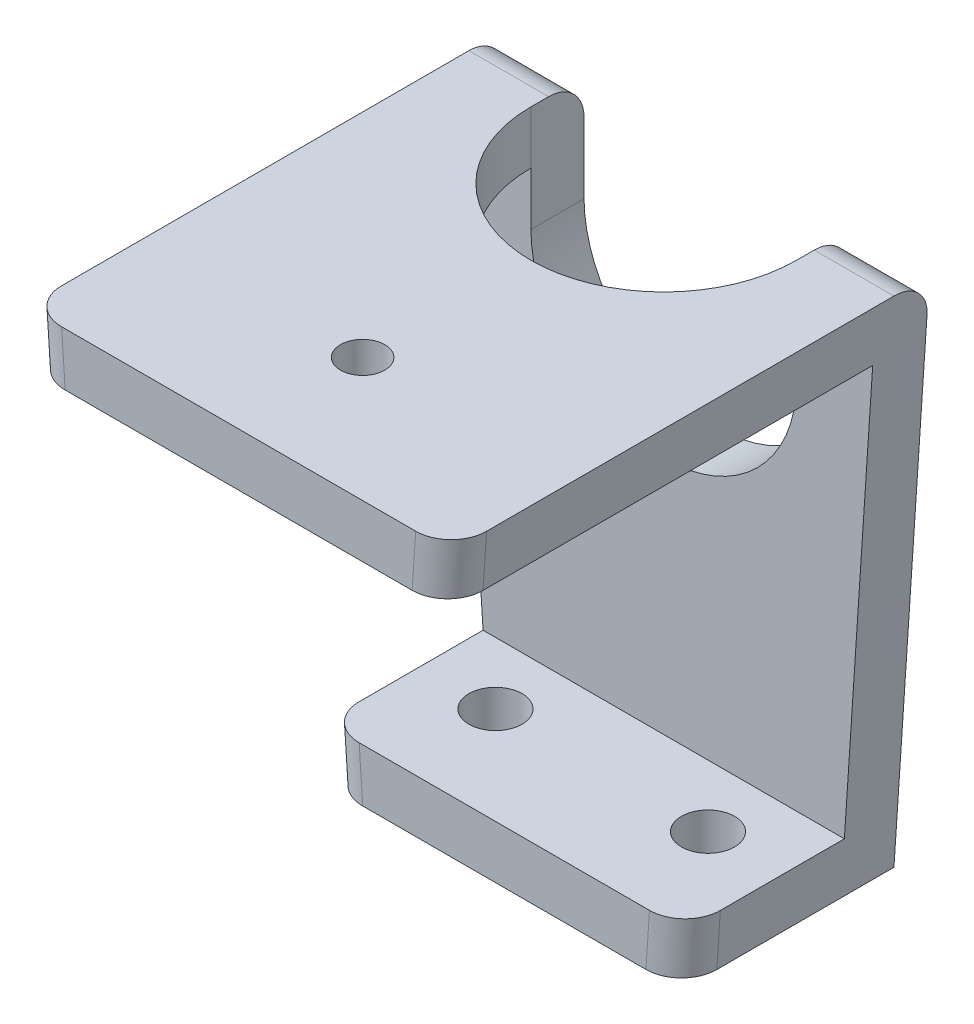
ISO-10303-21;
HEADER;
FILE_DESCRIPTION(('STEP AP214'),'2;1');
FILE_NAME('part.step','',(''),(''),'','','');
FILE_SCHEMA(('AUTOMOTIVE_DESIGN { 1 0 10303 214 1 1 1 1 }'));
ENDSEC;
DATA;
#1=APPLICATION_CONTEXT('core data for automotive mechanical design processes');
#2=APPLICATION_PROTOCOL_DEFINITION('international standard','automotive_design',2000,#1);
#3=PRODUCT_CONTEXT('',#1,'mechanical');
#4=PRODUCT('Part','Part','',(#3));
#5=PRODUCT_RELATED_PRODUCT_CATEGORY('part','',(#4));
#6=PRODUCT_DEFINITION_FORMATION('','',#4);
#7=PRODUCT_DEFINITION_CONTEXT('part definition',#1,'design');
#8=PRODUCT_DEFINITION('design','',#6,#7);
#9=PRODUCT_DEFINITION_SHAPE('','',#8);
#10=(LENGTH_UNIT() NAMED_UNIT(*) SI_UNIT(.MILLI.,.METRE.));
#11=(NAMED_UNIT(*) PLANE_ANGLE_UNIT() SI_UNIT($,.RADIAN.));
#12=(NAMED_UNIT(*) SI_UNIT($,.STERADIAN.) SOLID_ANGLE_UNIT());
#13=UNCERTAINTY_MEASURE_WITH_UNIT(LENGTH_MEASURE(1.E-05),#10,'distance_accuracy_value','');
#14=(GEOMETRIC_REPRESENTATION_CONTEXT(3) GLOBAL_UNCERTAINTY_ASSIGNED_CONTEXT((#13)) GLOBAL_UNIT_ASSIGNED_CONTEXT((#10,
#11,#12)) REPRESENTATION_CONTEXT('',''));
#15=CARTESIAN_POINT('',(0.,0.,0.));
#16=DIRECTION('',(0.,0.,1.));
#17=DIRECTION('',(1.,0.,0.));
#18=AXIS2_PLACEMENT_3D('',#15,#16,#17);
#19=CARTESIAN_POINT('',(22.,29.9332590941915,3.));
#20=DIRECTION('',(0.,-1.,0.));
#21=DIRECTION('',(0.,0.,-1.));
#22=AXIS2_PLACEMENT_3D('',#19,#20,#21);
#23=PLANE('',#22);
#24=CARTESIAN_POINT('',(10.,29.9332590941915,20.));
#25=DIRECTION('',(0.,-1.,0.));
#26=DIRECTION('',(0.,0.,-1.));
#27=AXIS2_PLACEMENT_3D('',#24,#25,#26);
#28=CIRCLE('',#27,1.25);
#29=CARTESIAN_POINT('',(10.,29.9332590941915,18.75));
#30=VERTEX_POINT('',#29);
#31=EDGE_CURVE('E217',#30,#30,#28,.T.);
#32=ORIENTED_EDGE('',*,*,#31,.T.);
#33=EDGE_LOOP('',(#32));
#34=FACE_BOUND('',#33,.T.);
#35=DIRECTION('',(0.,0.,1.));
#36=VECTOR('',#35,1.);
#37=CARTESIAN_POINT('',(2.5,29.9332590941915,3.));
#38=LINE('',#37,#36);
#39=CARTESIAN_POINT('',(2.5,29.9332590941915,2.));
#40=VERTEX_POINT('',#39);
#41=CARTESIAN_POINT('',(2.5,29.9332590941915,3.));
#42=VERTEX_POINT('',#41);
#43=EDGE_CURVE('E353',#40,#42,#38,.T.);
#44=ORIENTED_EDGE('',*,*,#43,.F.);
#45=DIRECTION('',(-1.,0.,0.));
#46=VECTOR('',#45,1.);
#47=CARTESIAN_POINT('',(22.,29.9332590941915,2.));
#48=LINE('',#47,#46);
#49=CARTESIAN_POINT('',(-2.,29.9332590941915,2.));
#50=VERTEX_POINT('',#49);
#51=EDGE_CURVE('E288',#40,#50,#48,.T.);
#52=ORIENTED_EDGE('',*,*,#51,.T.);
#53=DIRECTION('',(0.,0.,-1.));
#54=VECTOR('',#53,1.);
#55=CARTESIAN_POINT('',(-2.,29.9332590941915,3.));
#56=LINE('',#55,#54);
#57=CARTESIAN_POINT('',(-2.,29.9332590941915,25.));
#58=VERTEX_POINT('',#57);
#59=EDGE_CURVE('E264',#58,#50,#56,.T.);
#60=ORIENTED_EDGE('',*,*,#59,.F.);
#61=CARTESIAN_POINT('',(0.00445931434318479,29.9332590941915,25.));
#62=DIRECTION('',(0.,-1.,0.));
#63=DIRECTION('',(1.,0.,0.));
#64=AXIS2_PLACEMENT_3D('',#61,#62,#63);
#65=ELLIPSE('',#64,2.00445931434318,2.);
#66=CARTESIAN_POINT('',(0.00445931434318435,29.9332590941915,27.));
#67=VERTEX_POINT('',#66);
#68=EDGE_CURVE('E283',#58,#67,#65,.F.);
#69=ORIENTED_EDGE('',*,*,#68,.T.);
#70=DIRECTION('',(-1.,0.,0.));
#71=VECTOR('',#70,1.);
#72=CARTESIAN_POINT('',(-2.,29.9332590941915,27.));
#73=LINE('',#72,#71);
#74=CARTESIAN_POINT('',(19.9955406856568,29.9332590941915,27.));
#75=VERTEX_POINT('',#74);
#76=EDGE_CURVE('E235',#75,#67,#73,.T.);
#77=ORIENTED_EDGE('',*,*,#76,.F.);
#78=CARTESIAN_POINT('',(19.9955406856568,29.9332590941915,25.));
#79=DIRECTION('',(0.,-1.,0.));
#80=DIRECTION('',(1.,0.,0.));
#81=AXIS2_PLACEMENT_3D('',#78,#79,#80);
#82=ELLIPSE('',#81,2.00445931434318,2.);
#83=CARTESIAN_POINT('',(22.,29.9332590941915,25.));
#84=VERTEX_POINT('',#83);
#85=EDGE_CURVE('E281',#75,#84,#82,.F.);
#86=ORIENTED_EDGE('',*,*,#85,.T.);
#87=DIRECTION('',(0.,0.,-1.));
#88=VECTOR('',#87,1.);
#89=CARTESIAN_POINT('',(22.,29.9332590941915,3.));
#90=LINE('',#89,#88);
#91=CARTESIAN_POINT('',(22.,29.9332590941915,2.));
#92=VERTEX_POINT('',#91);
#93=EDGE_CURVE('E274',#84,#92,#90,.T.);
#94=ORIENTED_EDGE('',*,*,#93,.T.);
#95=DIRECTION('',(-1.,0.,0.));
#96=VECTOR('',#95,1.);
#97=CARTESIAN_POINT('',(22.,29.9332590941915,2.));
#98=LINE('',#97,#96);
#99=CARTESIAN_POINT('',(17.5,29.9332590941915,2.));
#100=VERTEX_POINT('',#99);
#101=EDGE_CURVE('E285',#92,#100,#98,.T.);
#102=ORIENTED_EDGE('',*,*,#101,.T.);
#103=DIRECTION('',(0.,0.,-1.));
#104=VECTOR('',#103,1.);
#105=CARTESIAN_POINT('',(17.5,29.9332590941915,3.));
#106=LINE('',#105,#104);
#107=CARTESIAN_POINT('',(17.5,29.9332590941915,3.));
#108=VERTEX_POINT('',#107);
#109=EDGE_CURVE('E350',#108,#100,#106,.T.);
#110=ORIENTED_EDGE('',*,*,#109,.F.);
#111=CARTESIAN_POINT('',(10.,29.9332590941915,3.));
#112=DIRECTION('',(0.,-1.,0.));
#113=DIRECTION('',(0.,0.,-1.));
#114=AXIS2_PLACEMENT_3D('',#111,#112,#113);
#115=CIRCLE('',#114,7.5);
#116=EDGE_CURVE('E199',#42,#108,#115,.F.);
#117=ORIENTED_EDGE('',*,*,#116,.F.);
#118=EDGE_LOOP('',(#44,#52,#60,#69,#77,#86,#94,#102,#110,#117));
#119=FACE_BOUND('',#118,.T.);
#120=ADVANCED_FACE('F60',(#34,#119),#23,.F.);
#121=CARTESIAN_POINT('',(0.,0.,0.));
#122=DIRECTION('',(0.,0.,1.));
#123=DIRECTION('',(1.,0.,0.));
#124=AXIS2_PLACEMENT_3D('',#121,#122,#123);
#125=PLANE('',#124);
#126=DIRECTION('',(0.0666666666666666,-0.997775303139718,0.));
#127=VECTOR('',#126,1.);
#128=CARTESIAN_POINT('',(-2.,29.9332590941915,0.));
#129=LINE('',#128,#127);
#130=CARTESIAN_POINT('',(-1.86636937904379,27.9332590941915,0.));
#131=VERTEX_POINT('',#130);
#132=CARTESIAN_POINT('',(0.,0.,0.));
#133=VERTEX_POINT('',#132);
#134=EDGE_CURVE('E258',#131,#133,#129,.T.);
#135=ORIENTED_EDGE('',*,*,#134,.F.);
#136=DIRECTION('',(-1.,0.,0.));
#137=VECTOR('',#136,1.);
#138=CARTESIAN_POINT('',(0.,27.9332590941915,0.));
#139=LINE('',#138,#137);
#140=CARTESIAN_POINT('',(2.5,27.9332590941915,0.));
#141=VERTEX_POINT('',#140);
#142=EDGE_CURVE('E299',#131,#141,#139,.F.);
#143=ORIENTED_EDGE('',*,*,#142,.T.);
#144=DIRECTION('',(0.,-1.,0.));
#145=VECTOR('',#144,1.);
#146=CARTESIAN_POINT('',(2.5,23.9399331847724,0.));
#147=LINE('',#146,#145);
#148=CARTESIAN_POINT('',(2.5,23.9399331847724,0.));
#149=VERTEX_POINT('',#148);
#150=EDGE_CURVE('E227',#141,#149,#147,.T.);
#151=ORIENTED_EDGE('',*,*,#150,.T.);
#152=CARTESIAN_POINT('',(10.,23.9999999999998,0.));
#153=DIRECTION('',(0.,0.,1.));
#154=DIRECTION('',(-1.,0.,0.));
#155=AXIS2_PLACEMENT_3D('',#152,#153,#154);
#156=CIRCLE('',#155,7.50024053096243);
#157=CARTESIAN_POINT('',(17.5,23.9399331847724,0.));
#158=VERTEX_POINT('',#157);
#159=EDGE_CURVE('E357',#149,#158,#156,.T.);
#160=ORIENTED_EDGE('',*,*,#159,.T.);
#161=DIRECTION('',(0.,1.,0.));
#162=VECTOR('',#161,1.);
#163=CARTESIAN_POINT('',(17.5,26.9399331847724,0.));
#164=LINE('',#163,#162);
#165=CARTESIAN_POINT('',(17.5,27.9332590941915,0.));
#166=VERTEX_POINT('',#165);
#167=EDGE_CURVE('E360',#158,#166,#164,.T.);
#168=ORIENTED_EDGE('',*,*,#167,.T.);
#169=DIRECTION('',(-1.,0.,0.));
#170=VECTOR('',#169,1.);
#171=CARTESIAN_POINT('',(0.,27.9332590941915,0.));
#172=LINE('',#171,#170);
#173=CARTESIAN_POINT('',(21.8663693790438,27.9332590941915,0.));
#174=VERTEX_POINT('',#173);
#175=EDGE_CURVE('E297',#166,#174,#172,.F.);
#176=ORIENTED_EDGE('',*,*,#175,.T.);
#177=DIRECTION('',(0.0666666666666666,0.997775303139718,0.));
#178=VECTOR('',#177,1.);
#179=CARTESIAN_POINT('',(20.,0.,0.));
#180=LINE('',#179,#178);
#181=CARTESIAN_POINT('',(20.,0.,0.));
#182=VERTEX_POINT('',#181);
#183=EDGE_CURVE('E262',#182,#174,#180,.T.);
#184=ORIENTED_EDGE('',*,*,#183,.F.);
#185=DIRECTION('',(1.,0.,0.));
#186=VECTOR('',#185,1.);
#187=CARTESIAN_POINT('',(0.,0.,0.));
#188=LINE('',#187,#186);
#189=EDGE_CURVE('E267',#133,#182,#188,.T.);
#190=ORIENTED_EDGE('',*,*,#189,.F.);
#191=EDGE_LOOP('',(#135,#143,#151,#160,#168,#176,#184,#190));
#192=FACE_BOUND('',#191,.T.);
#193=ADVANCED_FACE('F390',(#192),#125,.F.);
#194=CARTESIAN_POINT('',(21.8,26.9399331847724,27.));
#195=DIRECTION('',(0.,1.,0.));
#196=DIRECTION('',(-1.,0.,0.));
#197=AXIS2_PLACEMENT_3D('',#194,#195,#196);
#198=PLANE('',#197);
#199=CARTESIAN_POINT('',(10.,26.9399331847724,20.));
#200=DIRECTION('',(0.,-1.,0.));
#201=DIRECTION('',(1.,0.,0.));
#202=AXIS2_PLACEMENT_3D('',#199,#200,#201);
#203=CIRCLE('',#202,1.25);
#204=CARTESIAN_POINT('',(11.25,26.9399331847724,20.));
#205=VERTEX_POINT('',#204);
#206=EDGE_CURVE('E336',#205,#205,#203,.T.);
#207=ORIENTED_EDGE('',*,*,#206,.F.);
#208=EDGE_LOOP('',(#207));
#209=FACE_BOUND('',#208,.T.);
#210=DIRECTION('',(1.,0.,0.));
#211=VECTOR('',#210,1.);
#212=CARTESIAN_POINT('',(21.8,26.9399331847724,27.));
#213=LINE('',#212,#211);
#214=CARTESIAN_POINT('',(0.204459314343191,26.9399331847724,27.));
#215=VERTEX_POINT('',#214);
#216=CARTESIAN_POINT('',(19.7955406856568,26.9399331847724,27.));
#217=VERTEX_POINT('',#216);
#218=EDGE_CURVE('E240',#215,#217,#213,.T.);
#219=ORIENTED_EDGE('',*,*,#218,.F.);
#220=CARTESIAN_POINT('',(0.204459314343185,26.9399331847724,25.));
#221=DIRECTION('',(0.,1.,0.));
#222=DIRECTION('',(1.,0.,0.));
#223=AXIS2_PLACEMENT_3D('',#220,#221,#222);
#224=ELLIPSE('',#223,2.00445931434318,2.);
#225=CARTESIAN_POINT('',(-1.8,26.9399331847724,25.));
#226=VERTEX_POINT('',#225);
#227=EDGE_CURVE('E319',#215,#226,#224,.F.);
#228=ORIENTED_EDGE('',*,*,#227,.T.);
#229=DIRECTION('',(0.,0.,-1.));
#230=VECTOR('',#229,1.);
#231=CARTESIAN_POINT('',(-1.8,26.9399331847724,27.));
#232=LINE('',#231,#230);
#233=CARTESIAN_POINT('',(-1.8,26.9399331847724,3.));
#234=VERTEX_POINT('',#233);
#235=EDGE_CURVE('E244',#226,#234,#232,.T.);
#236=ORIENTED_EDGE('',*,*,#235,.T.);
#237=DIRECTION('',(1.,0.,0.));
#238=VECTOR('',#237,1.);
#239=CARTESIAN_POINT('',(21.8,26.9399331847724,3.));
#240=LINE('',#239,#238);
#241=CARTESIAN_POINT('',(2.5,26.9399331847724,3.));
#242=VERTEX_POINT('',#241);
#243=EDGE_CURVE('E216',#234,#242,#240,.T.);
#244=ORIENTED_EDGE('',*,*,#243,.T.);
#245=CARTESIAN_POINT('',(10.,26.9399331847724,3.));
#246=DIRECTION('',(0.,1.,0.));
#247=DIRECTION('',(1.,0.,0.));
#248=AXIS2_PLACEMENT_3D('',#245,#246,#247);
#249=CIRCLE('',#248,7.5);
#250=CARTESIAN_POINT('',(17.5,26.9399331847724,3.));
#251=VERTEX_POINT('',#250);
#252=EDGE_CURVE('E196',#242,#251,#249,.T.);
#253=ORIENTED_EDGE('',*,*,#252,.T.);
#254=CARTESIAN_POINT('',(21.8,26.9399331847724,3.));
#255=VERTEX_POINT('',#254);
#256=EDGE_CURVE('E213',#251,#255,#240,.T.);
#257=ORIENTED_EDGE('',*,*,#256,.T.);
#258=DIRECTION('',(0.,0.,-1.));
#259=VECTOR('',#258,1.);
#260=CARTESIAN_POINT('',(21.8,26.9399331847724,27.));
#261=LINE('',#260,#259);
#262=CARTESIAN_POINT('',(21.8,26.9399331847724,25.));
#263=VERTEX_POINT('',#262);
#264=EDGE_CURVE('E242',#263,#255,#261,.T.);
#265=ORIENTED_EDGE('',*,*,#264,.F.);
#266=CARTESIAN_POINT('',(19.7955406856568,26.9399331847724,25.));
#267=DIRECTION('',(0.,1.,0.));
#268=DIRECTION('',(1.,0.,0.));
#269=AXIS2_PLACEMENT_3D('',#266,#267,#268);
#270=ELLIPSE('',#269,2.00445931434318,2.);
#271=EDGE_CURVE('E317',#263,#217,#270,.F.);
#272=ORIENTED_EDGE('',*,*,#271,.T.);
#273=EDGE_LOOP('',(#219,#228,#236,#244,#253,#257,#265,#272));
#274=FACE_BOUND('',#273,.T.);
#275=ADVANCED_FACE('F210',(#209,#274),#198,.F.);
#276=CARTESIAN_POINT('',(0.,0.,3.));
#277=DIRECTION('',(0.,0.,1.));
#278=DIRECTION('',(1.,0.,0.));
#279=AXIS2_PLACEMENT_3D('',#276,#277,#278);
#280=PLANE('',#279);
#281=DIRECTION('',(0.,1.,0.));
#282=VECTOR('',#281,1.);
#283=CARTESIAN_POINT('',(17.5,26.9399331847724,3.));
#284=LINE('',#283,#282);
#285=CARTESIAN_POINT('',(17.5,23.9399331847724,3.));
#286=VERTEX_POINT('',#285);
#287=EDGE_CURVE('E220',#286,#251,#284,.T.);
#288=ORIENTED_EDGE('',*,*,#287,.F.);
#289=CARTESIAN_POINT('',(10.,23.9999999999998,3.));
#290=DIRECTION('',(0.,0.,1.));
#291=DIRECTION('',(-1.,0.,0.));
#292=AXIS2_PLACEMENT_3D('',#289,#290,#291);
#293=CIRCLE('',#292,7.50024053096243);
#294=CARTESIAN_POINT('',(2.50000000000001,23.9399331847724,3.));
#295=VERTEX_POINT('',#294);
#296=EDGE_CURVE('E228',#295,#286,#293,.T.);
#297=ORIENTED_EDGE('',*,*,#296,.F.);
#298=DIRECTION('',(0.,-1.,0.));
#299=VECTOR('',#298,1.);
#300=CARTESIAN_POINT('',(2.5,23.9399331847724,3.));
#301=LINE('',#300,#299);
#302=EDGE_CURVE('E355',#242,#295,#301,.T.);
#303=ORIENTED_EDGE('',*,*,#302,.F.);
#304=ORIENTED_EDGE('',*,*,#243,.F.);
#305=DIRECTION('',(0.0666666666666666,-0.997775303139718,0.));
#306=VECTOR('',#305,1.);
#307=CARTESIAN_POINT('',(-2.,29.9332590941915,3.));
#308=LINE('',#307,#306);
#309=CARTESIAN_POINT('',(-0.2,2.99332590941915,3.));
#310=VERTEX_POINT('',#309);
#311=EDGE_CURVE('E259',#234,#310,#308,.T.);
#312=ORIENTED_EDGE('',*,*,#311,.T.);
#313=DIRECTION('',(-1.,0.,0.));
#314=VECTOR('',#313,1.);
#315=CARTESIAN_POINT('',(20.2,2.99332590941915,3.));
#316=LINE('',#315,#314);
#317=CARTESIAN_POINT('',(20.2,2.99332590941915,3.));
#318=VERTEX_POINT('',#317);
#319=EDGE_CURVE('E246',#318,#310,#316,.T.);
#320=ORIENTED_EDGE('',*,*,#319,.F.);
#321=DIRECTION('',(0.0666666666666666,0.997775303139718,0.));
#322=VECTOR('',#321,1.);
#323=CARTESIAN_POINT('',(20.,0.,3.));
#324=LINE('',#323,#322);
#325=EDGE_CURVE('E233',#318,#255,#324,.T.);
#326=ORIENTED_EDGE('',*,*,#325,.T.);
#327=ORIENTED_EDGE('',*,*,#256,.F.);
#328=EDGE_LOOP('',(#288,#297,#303,#304,#312,#320,#326,#327));
#329=FACE_BOUND('',#328,.T.);
#330=ADVANCED_FACE('F230',(#329),#280,.T.);
#331=CARTESIAN_POINT('',(-2.,29.9332590941915,3.));
#332=DIRECTION('',(0.997775303139718,0.0666666666666666,0.));
#333=DIRECTION('',(-0.0666666666666666,0.997775303139718,0.));
#334=AXIS2_PLACEMENT_3D('',#331,#332,#333);
#335=PLANE('',#334);
#336=ORIENTED_EDGE('',*,*,#59,.T.);
#337=CARTESIAN_POINT('',(-1.86636937904379,27.9332590941915,2.));
#338=DIRECTION('',(0.997775303139718,0.0666666666666666,0.));
#339=DIRECTION('',(-0.0666666666666666,0.997775303139718,0.));
#340=AXIS2_PLACEMENT_3D('',#337,#338,#339);
#341=ELLIPSE('',#340,2.00445931434318,2.);
#342=EDGE_CURVE('E295',#50,#131,#341,.F.);
#343=ORIENTED_EDGE('',*,*,#342,.T.);
#344=ORIENTED_EDGE('',*,*,#134,.T.);
#345=DIRECTION('',(0.,0.,-1.));
#346=VECTOR('',#345,1.);
#347=CARTESIAN_POINT('',(0.,0.,3.));
#348=LINE('',#347,#346);
#349=CARTESIAN_POINT('',(0.,0.,10.));
#350=VERTEX_POINT('',#349);
#351=EDGE_CURVE('E279',#350,#133,#348,.T.);
#352=ORIENTED_EDGE('',*,*,#351,.F.);
#353=DIRECTION('',(0.0666666666666666,-0.997775303139718,0.));
#354=VECTOR('',#353,1.);
#355=CARTESIAN_POINT('',(-0.2,2.99332590941915,10.));
#356=LINE('',#355,#354);
#357=CARTESIAN_POINT('',(-0.2,2.99332590941915,10.));
#358=VERTEX_POINT('',#357);
#359=EDGE_CURVE('E291',#350,#358,#356,.F.);
#360=ORIENTED_EDGE('',*,*,#359,.T.);
#361=DIRECTION('',(0.,0.,-1.));
#362=VECTOR('',#361,1.);
#363=CARTESIAN_POINT('',(-0.2,2.99332590941915,12.));
#364=LINE('',#363,#362);
#365=EDGE_CURVE('E252',#358,#310,#364,.T.);
#366=ORIENTED_EDGE('',*,*,#365,.T.);
#367=ORIENTED_EDGE('',*,*,#311,.F.);
#368=ORIENTED_EDGE('',*,*,#235,.F.);
#369=DIRECTION('',(0.0666666666666666,-0.997775303139718,0.));
#370=VECTOR('',#369,1.);
#371=CARTESIAN_POINT('',(-2.,29.9332590941915,25.));
#372=LINE('',#371,#370);
#373=EDGE_CURVE('E293',#226,#58,#372,.F.);
#374=ORIENTED_EDGE('',*,*,#373,.T.);
#375=EDGE_LOOP('',(#336,#343,#344,#352,#360,#366,#367,#368,#374));
#376=FACE_BOUND('',#375,.T.);
#377=ADVANCED_FACE('F403',(#376),#335,.F.);
#378=CARTESIAN_POINT('',(0.,0.,3.));
#379=DIRECTION('',(0.,1.,0.));
#380=DIRECTION('',(0.,0.,1.));
#381=AXIS2_PLACEMENT_3D('',#378,#379,#380);
#382=PLANE('',#381);
#383=CARTESIAN_POINT('',(4.,0.,6.49999999999999));
#384=DIRECTION('',(0.,-1.,0.));
#385=DIRECTION('',(0.,0.,-1.));
#386=AXIS2_PLACEMENT_3D('',#383,#384,#385);
#387=CIRCLE('',#386,1.5);
#388=CARTESIAN_POINT('',(4.,0.,4.99999999999999));
#389=VERTEX_POINT('',#388);
#390=EDGE_CURVE('E332',#389,#389,#387,.T.);
#391=ORIENTED_EDGE('',*,*,#390,.F.);
#392=EDGE_LOOP('',(#391));
#393=FACE_BOUND('',#392,.T.);
#394=CARTESIAN_POINT('',(16.,0.,6.5));
#395=DIRECTION('',(0.,-1.,0.));
#396=DIRECTION('',(0.,0.,1.));
#397=AXIS2_PLACEMENT_3D('',#394,#395,#396);
#398=CIRCLE('',#397,1.5);
#399=CARTESIAN_POINT('',(16.,0.,8.));
#400=VERTEX_POINT('',#399);
#401=EDGE_CURVE('E338',#400,#400,#398,.T.);
#402=ORIENTED_EDGE('',*,*,#401,.F.);
#403=EDGE_LOOP('',(#402));
#404=FACE_BOUND('',#403,.T.);
#405=DIRECTION('',(1.,0.,0.));
#406=VECTOR('',#405,1.);
#407=CARTESIAN_POINT('',(0.,0.,12.));
#408=LINE('',#407,#406);
#409=CARTESIAN_POINT('',(2.00445931434318,0.,12.));
#410=VERTEX_POINT('',#409);
#411=CARTESIAN_POINT('',(17.9955406856568,0.,12.));
#412=VERTEX_POINT('',#411);
#413=EDGE_CURVE('E247',#410,#412,#408,.T.);
#414=ORIENTED_EDGE('',*,*,#413,.F.);
#415=CARTESIAN_POINT('',(2.00445931434318,0.,10.));
#416=DIRECTION('',(0.,1.,0.));
#417=DIRECTION('',(-1.,0.,0.));
#418=AXIS2_PLACEMENT_3D('',#415,#416,#417);
#419=ELLIPSE('',#418,2.00445931434318,2.);
#420=EDGE_CURVE('E328',#410,#350,#419,.F.);
#421=ORIENTED_EDGE('',*,*,#420,.T.);
#422=ORIENTED_EDGE('',*,*,#351,.T.);
#423=ORIENTED_EDGE('',*,*,#189,.T.);
#424=DIRECTION('',(0.,0.,-1.));
#425=VECTOR('',#424,1.);
#426=CARTESIAN_POINT('',(20.,0.,3.));
#427=LINE('',#426,#425);
#428=CARTESIAN_POINT('',(20.,0.,10.));
#429=VERTEX_POINT('',#428);
#430=EDGE_CURVE('E277',#429,#182,#427,.T.);
#431=ORIENTED_EDGE('',*,*,#430,.F.);
#432=CARTESIAN_POINT('',(17.9955406856568,0.,10.));
#433=DIRECTION('',(0.,1.,0.));
#434=DIRECTION('',(-1.,0.,0.));
#435=AXIS2_PLACEMENT_3D('',#432,#433,#434);
#436=ELLIPSE('',#435,2.00445931434318,2.);
#437=EDGE_CURVE('E326',#429,#412,#436,.F.);
#438=ORIENTED_EDGE('',*,*,#437,.T.);
#439=EDGE_LOOP('',(#414,#421,#422,#423,#431,#438));
#440=FACE_BOUND('',#439,.T.);
#441=ADVANCED_FACE('F415',(#393,#404,#440),#382,.F.);
#442=CARTESIAN_POINT('',(20.,0.,3.));
#443=DIRECTION('',(-0.997775303139718,0.0666666666666666,0.));
#444=DIRECTION('',(-0.0666666666666666,-0.997775303139718,0.));
#445=AXIS2_PLACEMENT_3D('',#442,#443,#444);
#446=PLANE('',#445);
#447=ORIENTED_EDGE('',*,*,#183,.T.);
#448=CARTESIAN_POINT('',(21.8663693790438,27.9332590941915,2.));
#449=DIRECTION('',(-0.997775303139718,0.0666666666666666,0.));
#450=DIRECTION('',(-0.0666666666666666,-0.997775303139718,0.));
#451=AXIS2_PLACEMENT_3D('',#448,#449,#450);
#452=ELLIPSE('',#451,2.00445931434318,2.);
#453=EDGE_CURVE('E309',#174,#92,#452,.F.);
#454=ORIENTED_EDGE('',*,*,#453,.T.);
#455=ORIENTED_EDGE('',*,*,#93,.F.);
#456=DIRECTION('',(0.0666666666666666,0.997775303139718,0.));
#457=VECTOR('',#456,1.);
#458=CARTESIAN_POINT('',(20.,0.,25.));
#459=LINE('',#458,#457);
#460=EDGE_CURVE('E307',#84,#263,#459,.F.);
#461=ORIENTED_EDGE('',*,*,#460,.T.);
#462=ORIENTED_EDGE('',*,*,#264,.T.);
#463=ORIENTED_EDGE('',*,*,#325,.F.);
#464=DIRECTION('',(0.,0.,-1.));
#465=VECTOR('',#464,1.);
#466=CARTESIAN_POINT('',(20.2,2.99332590941915,12.));
#467=LINE('',#466,#465);
#468=CARTESIAN_POINT('',(20.2,2.99332590941915,10.));
#469=VERTEX_POINT('',#468);
#470=EDGE_CURVE('E256',#469,#318,#467,.T.);
#471=ORIENTED_EDGE('',*,*,#470,.F.);
#472=DIRECTION('',(0.0666666666666666,0.997775303139718,0.));
#473=VECTOR('',#472,1.);
#474=CARTESIAN_POINT('',(20.,0.,10.));
#475=LINE('',#474,#473);
#476=EDGE_CURVE('E305',#469,#429,#475,.F.);
#477=ORIENTED_EDGE('',*,*,#476,.T.);
#478=ORIENTED_EDGE('',*,*,#430,.T.);
#479=EDGE_LOOP('',(#447,#454,#455,#461,#462,#463,#471,#477,#478));
#480=FACE_BOUND('',#479,.T.);
#481=ADVANCED_FACE('F382',(#480),#446,.F.);
#482=CARTESIAN_POINT('',(20.2,2.99332590941915,12.));
#483=DIRECTION('',(0.,-1.,0.));
#484=DIRECTION('',(1.,0.,0.));
#485=AXIS2_PLACEMENT_3D('',#482,#483,#484);
#486=PLANE('',#485);
#487=CARTESIAN_POINT('',(4.,2.99332590941915,6.49999999999999));
#488=DIRECTION('',(0.,-1.,0.));
#489=DIRECTION('',(1.,0.,0.));
#490=AXIS2_PLACEMENT_3D('',#487,#488,#489);
#491=CIRCLE('',#490,1.5);
#492=CARTESIAN_POINT('',(5.5,2.99332590941915,6.49999999999999));
#493=VERTEX_POINT('',#492);
#494=EDGE_CURVE('E64',#493,#493,#491,.T.);
#495=ORIENTED_EDGE('',*,*,#494,.T.);
#496=EDGE_LOOP('',(#495));
#497=FACE_BOUND('',#496,.T.);
#498=CARTESIAN_POINT('',(16.,2.99332590941915,6.5));
#499=DIRECTION('',(0.,-1.,0.));
#500=DIRECTION('',(1.,0.,0.));
#501=AXIS2_PLACEMENT_3D('',#498,#499,#500);
#502=CIRCLE('',#501,1.5);
#503=CARTESIAN_POINT('',(17.5,2.99332590941915,6.5));
#504=VERTEX_POINT('',#503);
#505=EDGE_CURVE('E330',#504,#504,#502,.T.);
#506=ORIENTED_EDGE('',*,*,#505,.T.);
#507=EDGE_LOOP('',(#506));
#508=FACE_BOUND('',#507,.T.);
#509=ORIENTED_EDGE('',*,*,#365,.F.);
#510=CARTESIAN_POINT('',(1.80445931434318,2.99332590941915,10.));
#511=DIRECTION('',(0.,-1.,0.));
#512=DIRECTION('',(-1.,0.,0.));
#513=AXIS2_PLACEMENT_3D('',#510,#511,#512);
#514=ELLIPSE('',#513,2.00445931434318,2.);
#515=CARTESIAN_POINT('',(1.80445931434318,2.99332590941915,12.));
#516=VERTEX_POINT('',#515);
#517=EDGE_CURVE('E12',#358,#516,#514,.F.);
#518=ORIENTED_EDGE('',*,*,#517,.T.);
#519=DIRECTION('',(-1.,0.,0.));
#520=VECTOR('',#519,1.);
#521=CARTESIAN_POINT('',(20.2,2.99332590941915,12.));
#522=LINE('',#521,#520);
#523=CARTESIAN_POINT('',(18.1955406856568,2.99332590941915,12.));
#524=VERTEX_POINT('',#523);
#525=EDGE_CURVE('E250',#524,#516,#522,.T.);
#526=ORIENTED_EDGE('',*,*,#525,.F.);
#527=CARTESIAN_POINT('',(18.1955406856568,2.99332590941915,10.));
#528=DIRECTION('',(0.,-1.,0.));
#529=DIRECTION('',(-1.,0.,0.));
#530=AXIS2_PLACEMENT_3D('',#527,#528,#529);
#531=ELLIPSE('',#530,2.00445931434318,2.);
#532=EDGE_CURVE('E69',#524,#469,#531,.F.);
#533=ORIENTED_EDGE('',*,*,#532,.T.);
#534=ORIENTED_EDGE('',*,*,#470,.T.);
#535=ORIENTED_EDGE('',*,*,#319,.T.);
#536=EDGE_LOOP('',(#509,#518,#526,#533,#534,#535));
#537=FACE_BOUND('',#536,.T.);
#538=ADVANCED_FACE('F407',(#497,#508,#537),#486,.F.);
#539=CARTESIAN_POINT('',(0.,0.,12.));
#540=DIRECTION('',(0.,0.,1.));
#541=DIRECTION('',(1.,0.,0.));
#542=AXIS2_PLACEMENT_3D('',#539,#540,#541);
#543=PLANE('',#542);
#544=ORIENTED_EDGE('',*,*,#525,.T.);
#545=DIRECTION('',(0.0666666666666666,-0.997775303139718,0.));
#546=VECTOR('',#545,1.);
#547=CARTESIAN_POINT('',(1.99555060627944,0.133333333333333,12.));
#548=LINE('',#547,#546);
#549=EDGE_CURVE('E323',#516,#410,#548,.T.);
#550=ORIENTED_EDGE('',*,*,#549,.T.);
#551=ORIENTED_EDGE('',*,*,#413,.T.);
#552=DIRECTION('',(0.0666666666666666,0.997775303139718,0.));
#553=VECTOR('',#552,1.);
#554=CARTESIAN_POINT('',(18.2044493937206,3.12665924275249,12.));
#555=LINE('',#554,#553);
#556=EDGE_CURVE('E321',#412,#524,#555,.T.);
#557=ORIENTED_EDGE('',*,*,#556,.T.);
#558=EDGE_LOOP('',(#544,#550,#551,#557));
#559=FACE_BOUND('',#558,.T.);
#560=ADVANCED_FACE('F413',(#559),#543,.T.);
#561=CARTESIAN_POINT('',(0.,0.,27.));
#562=DIRECTION('',(0.,0.,-1.));
#563=DIRECTION('',(-1.,0.,0.));
#564=AXIS2_PLACEMENT_3D('',#561,#562,#563);
#565=PLANE('',#564);
#566=ORIENTED_EDGE('',*,*,#76,.T.);
#567=DIRECTION('',(0.0666666666666666,-0.997775303139718,0.));
#568=VECTOR('',#567,1.);
#569=CARTESIAN_POINT('',(1.99555060627944,0.133333333333333,27.));
#570=LINE('',#569,#568);
#571=EDGE_CURVE('E314',#67,#215,#570,.T.);
#572=ORIENTED_EDGE('',*,*,#571,.T.);
#573=ORIENTED_EDGE('',*,*,#218,.T.);
#574=DIRECTION('',(0.0666666666666666,0.997775303139718,0.));
#575=VECTOR('',#574,1.);
#576=CARTESIAN_POINT('',(17.9155605048317,-1.19703373751962,27.));
#577=LINE('',#576,#575);
#578=EDGE_CURVE('E311',#217,#75,#577,.T.);
#579=ORIENTED_EDGE('',*,*,#578,.T.);
#580=EDGE_LOOP('',(#566,#572,#573,#579));
#581=FACE_BOUND('',#580,.T.);
#582=ADVANCED_FACE('F372',(#581),#565,.F.);
#583=CARTESIAN_POINT('',(17.5,26.9399331847724,0.));
#584=DIRECTION('',(1.,0.,0.));
#585=DIRECTION('',(0.,1.,0.));
#586=AXIS2_PLACEMENT_3D('',#583,#584,#585);
#587=PLANE('',#586);
#588=ORIENTED_EDGE('',*,*,#109,.T.);
#589=CARTESIAN_POINT('',(17.5,27.9332590941915,2.));
#590=DIRECTION('',(1.,0.,0.));
#591=DIRECTION('',(0.,1.,0.));
#592=AXIS2_PLACEMENT_3D('',#589,#590,#591);
#593=CIRCLE('',#592,2.);
#594=EDGE_CURVE('E303',#100,#166,#593,.F.);
#595=ORIENTED_EDGE('',*,*,#594,.T.);
#596=ORIENTED_EDGE('',*,*,#167,.F.);
#597=DIRECTION('',(0.,0.,1.));
#598=VECTOR('',#597,1.);
#599=CARTESIAN_POINT('',(17.5,23.9399331847724,0.));
#600=LINE('',#599,#598);
#601=EDGE_CURVE('E223',#158,#286,#600,.T.);
#602=ORIENTED_EDGE('',*,*,#601,.T.);
#603=ORIENTED_EDGE('',*,*,#287,.T.);
#604=DIRECTION('',(0.,-1.,0.));
#605=VECTOR('',#604,1.);
#606=CARTESIAN_POINT('',(17.5,29.9399331847724,3.));
#607=LINE('',#606,#605);
#608=EDGE_CURVE('E192',#108,#251,#607,.T.);
#609=ORIENTED_EDGE('',*,*,#608,.F.);
#610=EDGE_LOOP('',(#588,#595,#596,#602,#603,#609));
#611=FACE_BOUND('',#610,.T.);
#612=ADVANCED_FACE('F221',(#611),#587,.F.);
#613=CARTESIAN_POINT('',(10.,23.9999999999998,0.));
#614=DIRECTION('',(0.,0.,1.));
#615=DIRECTION('',(1.,0.,0.));
#616=AXIS2_PLACEMENT_3D('',#613,#614,#615);
#617=CYLINDRICAL_SURFACE('',#616,7.50024053096243);
#618=ORIENTED_EDGE('',*,*,#296,.T.);
#619=ORIENTED_EDGE('',*,*,#601,.F.);
#620=ORIENTED_EDGE('',*,*,#159,.F.);
#621=DIRECTION('',(0.,0.,1.));
#622=VECTOR('',#621,1.);
#623=CARTESIAN_POINT('',(2.50000000000001,23.9399331847724,0.));
#624=LINE('',#623,#622);
#625=EDGE_CURVE('E236',#149,#295,#624,.T.);
#626=ORIENTED_EDGE('',*,*,#625,.T.);
#627=EDGE_LOOP('',(#618,#619,#620,#626));
#628=FACE_BOUND('',#627,.T.);
#629=ADVANCED_FACE('F395',(#628),#617,.F.);
#630=CARTESIAN_POINT('',(2.5,23.9399331847724,0.));
#631=DIRECTION('',(-1.,0.,0.));
#632=DIRECTION('',(0.,0.,1.));
#633=AXIS2_PLACEMENT_3D('',#630,#631,#632);
#634=PLANE('',#633);
#635=ORIENTED_EDGE('',*,*,#150,.F.);
#636=CARTESIAN_POINT('',(2.5,27.9332590941915,2.));
#637=DIRECTION('',(-1.,0.,0.));
#638=DIRECTION('',(0.,0.,1.));
#639=AXIS2_PLACEMENT_3D('',#636,#637,#638);
#640=CIRCLE('',#639,2.);
#641=EDGE_CURVE('E301',#141,#40,#640,.F.);
#642=ORIENTED_EDGE('',*,*,#641,.T.);
#643=ORIENTED_EDGE('',*,*,#43,.T.);
#644=DIRECTION('',(0.,-1.,0.));
#645=VECTOR('',#644,1.);
#646=CARTESIAN_POINT('',(2.5,29.9399331847724,3.));
#647=LINE('',#646,#645);
#648=EDGE_CURVE('E204',#42,#242,#647,.T.);
#649=ORIENTED_EDGE('',*,*,#648,.T.);
#650=ORIENTED_EDGE('',*,*,#302,.T.);
#651=ORIENTED_EDGE('',*,*,#625,.F.);
#652=EDGE_LOOP('',(#635,#642,#643,#649,#650,#651));
#653=FACE_BOUND('',#652,.T.);
#654=ADVANCED_FACE('F397',(#653),#634,.F.);
#655=CARTESIAN_POINT('',(10.,29.9399331847724,3.));
#656=DIRECTION('',(0.,-1.,0.));
#657=DIRECTION('',(1.,0.,0.));
#658=AXIS2_PLACEMENT_3D('',#655,#656,#657);
#659=CYLINDRICAL_SURFACE('',#658,7.5);
#660=ORIENTED_EDGE('',*,*,#116,.T.);
#661=ORIENTED_EDGE('',*,*,#608,.T.);
#662=ORIENTED_EDGE('',*,*,#252,.F.);
#663=ORIENTED_EDGE('',*,*,#648,.F.);
#664=EDGE_LOOP('',(#660,#661,#662,#663));
#665=FACE_BOUND('',#664,.T.);
#666=ADVANCED_FACE('F194',(#665),#659,.F.);
#667=CARTESIAN_POINT('',(22.,27.9332590941915,2.));
#668=DIRECTION('',(-1.,0.,0.));
#669=DIRECTION('',(0.,0.,1.));
#670=AXIS2_PLACEMENT_3D('',#667,#668,#669);
#671=CYLINDRICAL_SURFACE('',#670,2.);
#672=ORIENTED_EDGE('',*,*,#641,.F.);
#673=ORIENTED_EDGE('',*,*,#142,.F.);
#674=ORIENTED_EDGE('',*,*,#342,.F.);
#675=ORIENTED_EDGE('',*,*,#51,.F.);
#676=EDGE_LOOP('',(#672,#673,#674,#675));
#677=FACE_BOUND('',#676,.T.);
#678=ADVANCED_FACE('F422',(#677),#671,.T.);
#679=CARTESIAN_POINT('',(22.,27.9332590941915,2.));
#680=DIRECTION('',(-1.,0.,0.));
#681=DIRECTION('',(0.,0.,1.));
#682=AXIS2_PLACEMENT_3D('',#679,#680,#681);
#683=CYLINDRICAL_SURFACE('',#682,2.);
#684=ORIENTED_EDGE('',*,*,#453,.F.);
#685=ORIENTED_EDGE('',*,*,#175,.F.);
#686=ORIENTED_EDGE('',*,*,#594,.F.);
#687=ORIENTED_EDGE('',*,*,#101,.F.);
#688=EDGE_LOOP('',(#684,#685,#686,#687));
#689=FACE_BOUND('',#688,.T.);
#690=ADVANCED_FACE('F387',(#689),#683,.T.);
#691=CARTESIAN_POINT('',(1.99555060627944,0.133333333333333,25.));
#692=DIRECTION('',(0.0666666666666666,-0.997775303139718,0.));
#693=DIRECTION('',(0.997775303139718,0.0666666666666666,0.));
#694=AXIS2_PLACEMENT_3D('',#691,#692,#693);
#695=CYLINDRICAL_SURFACE('',#694,2.);
#696=ORIENTED_EDGE('',*,*,#68,.F.);
#697=ORIENTED_EDGE('',*,*,#373,.F.);
#698=ORIENTED_EDGE('',*,*,#227,.F.);
#699=ORIENTED_EDGE('',*,*,#571,.F.);
#700=EDGE_LOOP('',(#696,#697,#698,#699));
#701=FACE_BOUND('',#700,.T.);
#702=ADVANCED_FACE('F427',(#701),#695,.T.);
#703=CARTESIAN_POINT('',(17.9155605048317,-1.19703373751962,25.));
#704=DIRECTION('',(0.0666666666666666,0.997775303139718,0.));
#705=DIRECTION('',(-0.997775303139718,0.0666666666666666,0.));
#706=AXIS2_PLACEMENT_3D('',#703,#704,#705);
#707=CYLINDRICAL_SURFACE('',#706,2.);
#708=ORIENTED_EDGE('',*,*,#271,.F.);
#709=ORIENTED_EDGE('',*,*,#460,.F.);
#710=ORIENTED_EDGE('',*,*,#85,.F.);
#711=ORIENTED_EDGE('',*,*,#578,.F.);
#712=EDGE_LOOP('',(#708,#709,#710,#711));
#713=FACE_BOUND('',#712,.T.);
#714=ADVANCED_FACE('F375',(#713),#707,.T.);
#715=CARTESIAN_POINT('',(1.99555060627944,0.133333333333333,10.));
#716=DIRECTION('',(-0.0666666666666666,0.997775303139718,0.));
#717=DIRECTION('',(-0.997775303139718,-0.0666666666666666,0.));
#718=AXIS2_PLACEMENT_3D('',#715,#716,#717);
#719=CYLINDRICAL_SURFACE('',#718,2.);
#720=ORIENTED_EDGE('',*,*,#517,.F.);
#721=ORIENTED_EDGE('',*,*,#359,.F.);
#722=ORIENTED_EDGE('',*,*,#420,.F.);
#723=ORIENTED_EDGE('',*,*,#549,.F.);
#724=EDGE_LOOP('',(#720,#721,#722,#723));
#725=FACE_BOUND('',#724,.T.);
#726=ADVANCED_FACE('F410',(#725),#719,.T.);
#727=CARTESIAN_POINT('',(17.9155605048317,-1.19703373751962,10.));
#728=DIRECTION('',(-0.0666666666666666,-0.997775303139718,0.));
#729=DIRECTION('',(0.997775303139718,-0.0666666666666666,0.));
#730=AXIS2_PLACEMENT_3D('',#727,#728,#729);
#731=CYLINDRICAL_SURFACE('',#730,2.);
#732=ORIENTED_EDGE('',*,*,#437,.F.);
#733=ORIENTED_EDGE('',*,*,#476,.F.);
#734=ORIENTED_EDGE('',*,*,#532,.F.);
#735=ORIENTED_EDGE('',*,*,#556,.F.);
#736=EDGE_LOOP('',(#732,#733,#734,#735));
#737=FACE_BOUND('',#736,.T.);
#738=ADVANCED_FACE('F62',(#737),#731,.T.);
#739=CARTESIAN_POINT('',(10.,29.9399331847724,20.));
#740=DIRECTION('',(0.,-1.,0.));
#741=DIRECTION('',(1.,0.,0.));
#742=AXIS2_PLACEMENT_3D('',#739,#740,#741);
#743=CYLINDRICAL_SURFACE('',#742,1.25);
#744=ORIENTED_EDGE('',*,*,#206,.T.);
#745=EDGE_LOOP('',(#744));
#746=FACE_BOUND('',#745,.T.);
#747=ORIENTED_EDGE('',*,*,#31,.F.);
#748=EDGE_LOOP('',(#747));
#749=FACE_BOUND('',#748,.T.);
#750=ADVANCED_FACE('F463',(#746,#749),#743,.F.);
#751=CARTESIAN_POINT('',(16.,3.,6.5));
#752=DIRECTION('',(0.,-1.,0.));
#753=DIRECTION('',(0.,0.,-1.));
#754=AXIS2_PLACEMENT_3D('',#751,#752,#753);
#755=CYLINDRICAL_SURFACE('',#754,1.5);
#756=ORIENTED_EDGE('',*,*,#401,.T.);
#757=EDGE_LOOP('',(#756));
#758=FACE_BOUND('',#757,.T.);
#759=ORIENTED_EDGE('',*,*,#505,.F.);
#760=EDGE_LOOP('',(#759));
#761=FACE_BOUND('',#760,.T.);
#762=ADVANCED_FACE('F576',(#758,#761),#755,.F.);
#763=CARTESIAN_POINT('',(4.,3.,6.49999999999999));
#764=DIRECTION('',(0.,-1.,0.));
#765=DIRECTION('',(0.,0.,-1.));
#766=AXIS2_PLACEMENT_3D('',#763,#764,#765);
#767=CYLINDRICAL_SURFACE('',#766,1.5);
#768=ORIENTED_EDGE('',*,*,#390,.T.);
#769=EDGE_LOOP('',(#768));
#770=FACE_BOUND('',#769,.T.);
#771=ORIENTED_EDGE('',*,*,#494,.F.);
#772=EDGE_LOOP('',(#771));
#773=FACE_BOUND('',#772,.T.);
#774=ADVANCED_FACE('F585',(#770,#773),#767,.F.);
#775=CLOSED_SHELL('',(#120,#193,#275,#330,#377,#441,#481,#538,#560,#582,#612,#629,#654,#666,
#678,#690,#702,#714,#726,#738,#750,#762,#774));
#776=MANIFOLD_SOLID_BREP('B2',#775);
#777=ADVANCED_BREP_SHAPE_REPRESENTATION('',(#18,#776),#14);
#778=SHAPE_DEFINITION_REPRESENTATION(#9,#777);
ENDSEC;
END-ISO-10303-21;
